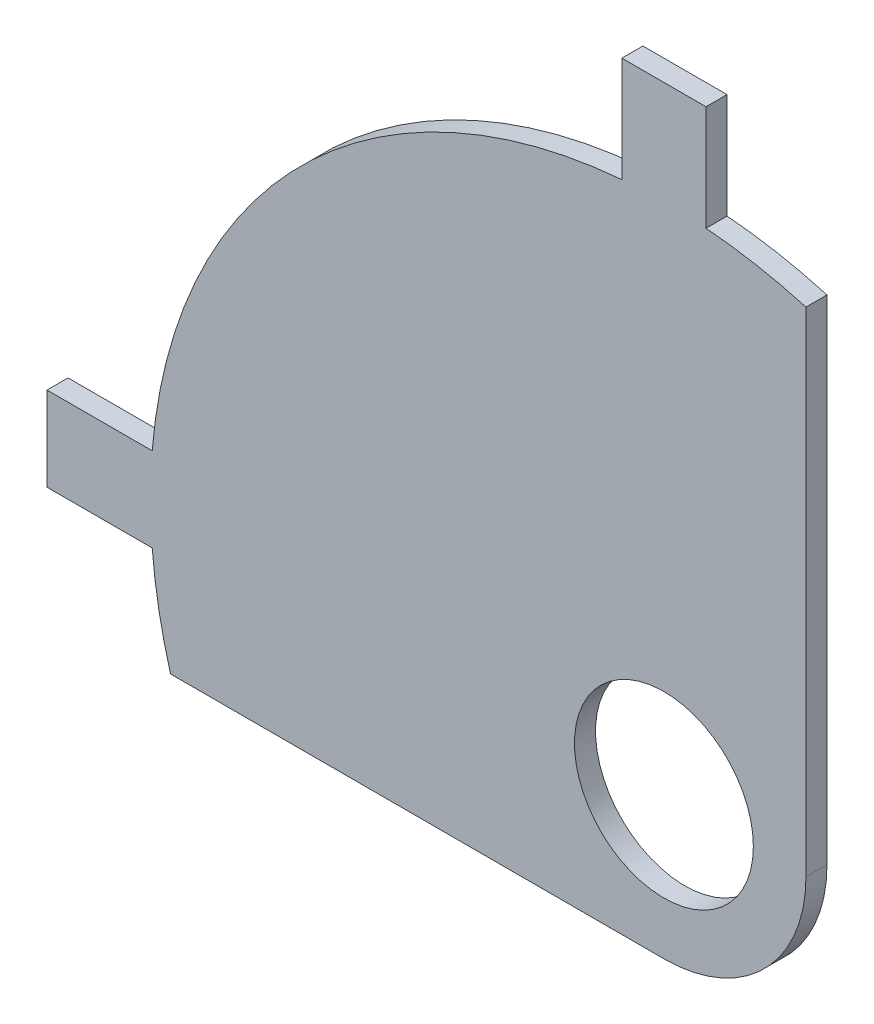
ISO-10303-21;
HEADER;
FILE_DESCRIPTION(('STEP AP214'),'2;1');
FILE_NAME('part.step','',(''),(''),'','','');
FILE_SCHEMA(('AUTOMOTIVE_DESIGN { 1 0 10303 214 1 1 1 1 }'));
ENDSEC;
DATA;
#1=APPLICATION_CONTEXT('core data for automotive mechanical design processes');
#2=APPLICATION_PROTOCOL_DEFINITION('international standard','automotive_design',2000,#1);
#3=PRODUCT_CONTEXT('',#1,'mechanical');
#4=PRODUCT('Part','Part','',(#3));
#5=PRODUCT_RELATED_PRODUCT_CATEGORY('part','',(#4));
#6=PRODUCT_DEFINITION_FORMATION('','',#4);
#7=PRODUCT_DEFINITION_CONTEXT('part definition',#1,'design');
#8=PRODUCT_DEFINITION('design','',#6,#7);
#9=PRODUCT_DEFINITION_SHAPE('','',#8);
#10=(LENGTH_UNIT() NAMED_UNIT(*) SI_UNIT(.MILLI.,.METRE.));
#11=(NAMED_UNIT(*) PLANE_ANGLE_UNIT() SI_UNIT($,.RADIAN.));
#12=(NAMED_UNIT(*) SI_UNIT($,.STERADIAN.) SOLID_ANGLE_UNIT());
#13=UNCERTAINTY_MEASURE_WITH_UNIT(LENGTH_MEASURE(1.E-05),#10,'distance_accuracy_value','');
#14=(GEOMETRIC_REPRESENTATION_CONTEXT(3) GLOBAL_UNCERTAINTY_ASSIGNED_CONTEXT((#13)) GLOBAL_UNIT_ASSIGNED_CONTEXT((#10,
#11,#12)) REPRESENTATION_CONTEXT('',''));
#15=CARTESIAN_POINT('',(0.,0.,0.));
#16=DIRECTION('',(0.,0.,1.));
#17=DIRECTION('',(1.,0.,0.));
#18=AXIS2_PLACEMENT_3D('',#15,#16,#17);
#19=CARTESIAN_POINT('',(-58.6357892914263,4.,0.));
#20=DIRECTION('',(1.,0.,0.));
#21=DIRECTION('',(0.,-1.,0.));
#22=AXIS2_PLACEMENT_3D('',#19,#20,#21);
#23=PLANE('',#22);
#24=DIRECTION('',(0.,0.,1.));
#25=VECTOR('',#24,1.);
#26=CARTESIAN_POINT('',(-58.6357892914263,4.,0.));
#27=LINE('',#26,#25);
#28=CARTESIAN_POINT('',(-58.6357892914268,4.00000000000003,-2.));
#29=VERTEX_POINT('',#28);
#30=CARTESIAN_POINT('',(-58.6357892914263,4.,0.));
#31=VERTEX_POINT('',#30);
#32=EDGE_CURVE('E11',#29,#31,#27,.T.);
#33=ORIENTED_EDGE('',*,*,#32,.F.);
#34=DIRECTION('',(0.,1.,0.));
#35=VECTOR('',#34,1.);
#36=CARTESIAN_POINT('',(-58.6357892914268,-3.70587303503938E-13,-2.));
#37=LINE('',#36,#35);
#38=CARTESIAN_POINT('',(-58.6357892914267,-3.99999999999987,-2.));
#39=VERTEX_POINT('',#38);
#40=EDGE_CURVE('E116',#29,#39,#37,.F.);
#41=ORIENTED_EDGE('',*,*,#40,.T.);
#42=DIRECTION('',(0.,0.,1.));
#43=VECTOR('',#42,1.);
#44=CARTESIAN_POINT('',(-58.6357892914262,-3.99999999999984,-2.22044604925031E-13));
#45=LINE('',#44,#43);
#46=CARTESIAN_POINT('',(-58.6357892914262,-3.99999999999984,-2.22044604925031E-13));
#47=VERTEX_POINT('',#46);
#48=EDGE_CURVE('E47',#39,#47,#45,.T.);
#49=ORIENTED_EDGE('',*,*,#48,.T.);
#50=DIRECTION('',(0.,-1.,0.));
#51=VECTOR('',#50,1.);
#52=CARTESIAN_POINT('',(-58.6357892914263,4.,0.));
#53=LINE('',#52,#51);
#54=EDGE_CURVE('E181',#31,#47,#53,.T.);
#55=ORIENTED_EDGE('',*,*,#54,.F.);
#56=EDGE_LOOP('',(#33,#41,#49,#55));
#57=FACE_BOUND('',#56,.T.);
#58=ADVANCED_FACE('F37',(#57),#23,.F.);
#59=CARTESIAN_POINT('',(-48.6357892914263,-3.99999999999986,0.));
#60=DIRECTION('',(0.,1.,0.));
#61=DIRECTION('',(1.,0.,0.));
#62=AXIS2_PLACEMENT_3D('',#59,#60,#61);
#63=PLANE('',#62);
#64=ORIENTED_EDGE('',*,*,#48,.F.);
#65=DIRECTION('',(-1.,0.,0.));
#66=VECTOR('',#65,1.);
#67=CARTESIAN_POINT('',(2.43527420451528E-13,-3.99999999999986,-2.));
#68=LINE('',#67,#66);
#69=CARTESIAN_POINT('',(-48.6357892914264,-3.9999999999999,-2.));
#70=VERTEX_POINT('',#69);
#71=EDGE_CURVE('E149',#39,#70,#68,.F.);
#72=ORIENTED_EDGE('',*,*,#71,.T.);
#73=DIRECTION('',(0.,0.,1.));
#74=VECTOR('',#73,1.);
#75=CARTESIAN_POINT('',(-48.6357892914263,-3.99999999999986,0.));
#76=LINE('',#75,#74);
#77=CARTESIAN_POINT('',(-48.6357892914263,-3.99999999999986,0.));
#78=VERTEX_POINT('',#77);
#79=EDGE_CURVE('E174',#70,#78,#76,.T.);
#80=ORIENTED_EDGE('',*,*,#79,.T.);
#81=DIRECTION('',(1.,0.,0.));
#82=VECTOR('',#81,1.);
#83=CARTESIAN_POINT('',(-48.6357892914263,-3.99999999999986,0.));
#84=LINE('',#83,#82);
#85=EDGE_CURVE('E190',#47,#78,#84,.T.);
#86=ORIENTED_EDGE('',*,*,#85,.F.);
#87=EDGE_LOOP('',(#64,#72,#80,#86));
#88=FACE_BOUND('',#87,.T.);
#89=ADVANCED_FACE('F193',(#88),#63,.F.);
#90=CARTESIAN_POINT('',(1.15879528195251E-12,4.64905891561784E-13,0.));
#91=DIRECTION('',(0.,0.,-1.));
#92=DIRECTION('',(-1.,0.,0.));
#93=AXIS2_PLACEMENT_3D('',#90,#91,#92);
#94=CYLINDRICAL_SURFACE('',#93,48.8000000000013);
#95=ORIENTED_EDGE('',*,*,#79,.F.);
#96=CARTESIAN_POINT('',(1.15879528195251E-12,4.64905891561784E-13,-2.));
#97=DIRECTION('',(0.,0.,1.));
#98=DIRECTION('',(1.,0.,0.));
#99=AXIS2_PLACEMENT_3D('',#96,#97,#98);
#100=CIRCLE('',#99,48.8000000000013);
#101=CARTESIAN_POINT('',(-46.8955221742975,-13.5,-2.));
#102=VERTEX_POINT('',#101);
#103=EDGE_CURVE('E146',#70,#102,#100,.T.);
#104=ORIENTED_EDGE('',*,*,#103,.T.);
#105=DIRECTION('',(0.,0.,1.));
#106=VECTOR('',#105,1.);
#107=CARTESIAN_POINT('',(-46.8955221742972,-13.4999999999998,0.));
#108=LINE('',#107,#106);
#109=CARTESIAN_POINT('',(-46.8955221742972,-13.4999999999998,0.));
#110=VERTEX_POINT('',#109);
#111=EDGE_CURVE('E171',#102,#110,#108,.T.);
#112=ORIENTED_EDGE('',*,*,#111,.T.);
#113=CARTESIAN_POINT('',(1.15879528195251E-12,4.64905891561784E-13,0.));
#114=DIRECTION('',(0.,0.,1.));
#115=DIRECTION('',(-1.,0.,0.));
#116=AXIS2_PLACEMENT_3D('',#113,#114,#115);
#117=CIRCLE('',#116,48.8000000000013);
#118=EDGE_CURVE('E194',#78,#110,#117,.T.);
#119=ORIENTED_EDGE('',*,*,#118,.F.);
#120=EDGE_LOOP('',(#95,#104,#112,#119));
#121=FACE_BOUND('',#120,.T.);
#122=ADVANCED_FACE('F251',(#121),#94,.T.);
#123=CARTESIAN_POINT('',(-1.17961196366423E-13,-13.5,0.));
#124=DIRECTION('',(0.,1.,0.));
#125=DIRECTION('',(1.,0.,0.));
#126=AXIS2_PLACEMENT_3D('',#123,#124,#125);
#127=PLANE('',#126);
#128=ORIENTED_EDGE('',*,*,#111,.F.);
#129=DIRECTION('',(-1.,0.,0.));
#130=VECTOR('',#129,1.);
#131=CARTESIAN_POINT('',(2.45109488261619E-13,-13.4999999999999,-2.));
#132=LINE('',#131,#130);
#133=CARTESIAN_POINT('',(-1.17961196366426E-13,-13.5000000000001,-2.));
#134=VERTEX_POINT('',#133);
#135=EDGE_CURVE('E143',#102,#134,#132,.F.);
#136=ORIENTED_EDGE('',*,*,#135,.T.);
#137=DIRECTION('',(0.,0.,1.));
#138=VECTOR('',#137,1.);
#139=CARTESIAN_POINT('',(-1.17961196366423E-13,-13.5,0.));
#140=LINE('',#139,#138);
#141=CARTESIAN_POINT('',(-1.17961196366423E-13,-13.5,0.));
#142=VERTEX_POINT('',#141);
#143=EDGE_CURVE('E168',#134,#142,#140,.T.);
#144=ORIENTED_EDGE('',*,*,#143,.T.);
#145=DIRECTION('',(1.,0.,0.));
#146=VECTOR('',#145,1.);
#147=CARTESIAN_POINT('',(-1.17961196366423E-13,-13.5,0.));
#148=LINE('',#147,#146);
#149=EDGE_CURVE('E196',#110,#142,#148,.T.);
#150=ORIENTED_EDGE('',*,*,#149,.F.);
#151=EDGE_LOOP('',(#128,#136,#144,#150));
#152=FACE_BOUND('',#151,.T.);
#153=ADVANCED_FACE('F256',(#152),#127,.F.);
#154=CARTESIAN_POINT('',(0.,0.,0.));
#155=DIRECTION('',(0.,0.,-1.));
#156=DIRECTION('',(-1.,0.,0.));
#157=AXIS2_PLACEMENT_3D('',#154,#155,#156);
#158=CYLINDRICAL_SURFACE('',#157,13.5);
#159=ORIENTED_EDGE('',*,*,#143,.F.);
#160=CARTESIAN_POINT('',(0.,0.,-2.));
#161=DIRECTION('',(0.,0.,1.));
#162=DIRECTION('',(1.,0.,0.));
#163=AXIS2_PLACEMENT_3D('',#160,#161,#162);
#164=CIRCLE('',#163,13.5);
#165=CARTESIAN_POINT('',(13.5000000000003,1.45716771982056E-13,-2.));
#166=VERTEX_POINT('',#165);
#167=EDGE_CURVE('E140',#134,#166,#164,.T.);
#168=ORIENTED_EDGE('',*,*,#167,.T.);
#169=DIRECTION('',(0.,0.,1.));
#170=VECTOR('',#169,1.);
#171=CARTESIAN_POINT('',(13.5000000000002,1.45716771982052E-13,0.));
#172=LINE('',#171,#170);
#173=CARTESIAN_POINT('',(13.5000000000002,1.45716771982052E-13,0.));
#174=VERTEX_POINT('',#173);
#175=EDGE_CURVE('E165',#166,#174,#172,.T.);
#176=ORIENTED_EDGE('',*,*,#175,.T.);
#177=CARTESIAN_POINT('',(0.,0.,0.));
#178=DIRECTION('',(0.,0.,1.));
#179=DIRECTION('',(-1.,0.,0.));
#180=AXIS2_PLACEMENT_3D('',#177,#178,#179);
#181=CIRCLE('',#180,13.5);
#182=EDGE_CURVE('E202',#142,#174,#181,.T.);
#183=ORIENTED_EDGE('',*,*,#182,.F.);
#184=EDGE_LOOP('',(#159,#168,#176,#183));
#185=FACE_BOUND('',#184,.T.);
#186=ADVANCED_FACE('F258',(#185),#158,.T.);
#187=CARTESIAN_POINT('',(13.4999999999999,46.8955221742973,-2.22044604925031E-13));
#188=DIRECTION('',(-1.,0.,0.));
#189=DIRECTION('',(0.,1.,0.));
#190=AXIS2_PLACEMENT_3D('',#187,#188,#189);
#191=PLANE('',#190);
#192=ORIENTED_EDGE('',*,*,#175,.F.);
#193=DIRECTION('',(0.,1.,0.));
#194=VECTOR('',#193,1.);
#195=CARTESIAN_POINT('',(13.5000000000003,-3.5857428137831E-13,-2.));
#196=LINE('',#195,#194);
#197=CARTESIAN_POINT('',(13.5000000000004,46.8955221742974,-2.));
#198=VERTEX_POINT('',#197);
#199=EDGE_CURVE('E137',#166,#198,#196,.T.);
#200=ORIENTED_EDGE('',*,*,#199,.T.);
#201=DIRECTION('',(0.,0.,1.));
#202=VECTOR('',#201,1.);
#203=CARTESIAN_POINT('',(13.4999999999999,46.8955221742973,-2.22044604925031E-13));
#204=LINE('',#203,#202);
#205=CARTESIAN_POINT('',(13.4999999999999,46.8955221742973,-2.22044604925031E-13));
#206=VERTEX_POINT('',#205);
#207=EDGE_CURVE('E162',#198,#206,#204,.T.);
#208=ORIENTED_EDGE('',*,*,#207,.T.);
#209=DIRECTION('',(0.,1.,0.));
#210=VECTOR('',#209,1.);
#211=CARTESIAN_POINT('',(13.4999999999999,46.8955221742973,-2.22044604925031E-13));
#212=LINE('',#211,#210);
#213=EDGE_CURVE('E205',#174,#206,#212,.T.);
#214=ORIENTED_EDGE('',*,*,#213,.F.);
#215=EDGE_LOOP('',(#192,#200,#208,#214));
#216=FACE_BOUND('',#215,.T.);
#217=ADVANCED_FACE('F239',(#216),#191,.F.);
#218=CARTESIAN_POINT('',(-2.47718512369488E-12,-1.35447209004269E-11,0.));
#219=DIRECTION('',(0.,0.,-1.));
#220=DIRECTION('',(-1.,0.,0.));
#221=AXIS2_PLACEMENT_3D('',#218,#219,#220);
#222=CYLINDRICAL_SURFACE('',#221,48.8000000000138);
#223=ORIENTED_EDGE('',*,*,#207,.F.);
#224=CARTESIAN_POINT('',(-2.47718512369488E-12,-1.35447209004269E-11,-2.));
#225=DIRECTION('',(0.,0.,1.));
#226=DIRECTION('',(1.,0.,0.));
#227=AXIS2_PLACEMENT_3D('',#224,#225,#226);
#228=CIRCLE('',#227,48.8000000000138);
#229=CARTESIAN_POINT('',(4.00000000000007,48.6357892914264,-2.));
#230=VERTEX_POINT('',#229);
#231=EDGE_CURVE('E134',#198,#230,#228,.T.);
#232=ORIENTED_EDGE('',*,*,#231,.T.);
#233=DIRECTION('',(0.,0.,1.));
#234=VECTOR('',#233,1.);
#235=CARTESIAN_POINT('',(4.,48.6357892914263,-2.22044604925031E-13));
#236=LINE('',#235,#234);
#237=CARTESIAN_POINT('',(4.,48.6357892914263,-2.22044604925031E-13));
#238=VERTEX_POINT('',#237);
#239=EDGE_CURVE('E159',#230,#238,#236,.T.);
#240=ORIENTED_EDGE('',*,*,#239,.T.);
#241=CARTESIAN_POINT('',(-2.47718512369488E-12,-1.35447209004269E-11,0.));
#242=DIRECTION('',(0.,0.,1.));
#243=DIRECTION('',(-1.,0.,0.));
#244=AXIS2_PLACEMENT_3D('',#241,#242,#243);
#245=CIRCLE('',#244,48.8000000000138);
#246=EDGE_CURVE('E208',#206,#238,#245,.T.);
#247=ORIENTED_EDGE('',*,*,#246,.F.);
#248=EDGE_LOOP('',(#223,#232,#240,#247));
#249=FACE_BOUND('',#248,.T.);
#250=ADVANCED_FACE('F231',(#249),#222,.T.);
#251=CARTESIAN_POINT('',(4.,48.6357892914263,-2.22044604925031E-13));
#252=DIRECTION('',(-1.,0.,0.));
#253=DIRECTION('',(0.,1.,0.));
#254=AXIS2_PLACEMENT_3D('',#251,#252,#253);
#255=PLANE('',#254);
#256=ORIENTED_EDGE('',*,*,#239,.F.);
#257=DIRECTION('',(0.,1.,0.));
#258=VECTOR('',#257,1.);
#259=CARTESIAN_POINT('',(4.00000000000004,-3.60156349188401E-13,-2.));
#260=LINE('',#259,#258);
#261=CARTESIAN_POINT('',(4.0000000000002,58.6357892914268,-2.));
#262=VERTEX_POINT('',#261);
#263=EDGE_CURVE('E131',#230,#262,#260,.T.);
#264=ORIENTED_EDGE('',*,*,#263,.T.);
#265=DIRECTION('',(0.,0.,1.));
#266=VECTOR('',#265,1.);
#267=CARTESIAN_POINT('',(4.00000000000017,58.6357892914263,-2.22044604925031E-13));
#268=LINE('',#267,#266);
#269=CARTESIAN_POINT('',(4.00000000000017,58.6357892914263,-2.22044604925031E-13));
#270=VERTEX_POINT('',#269);
#271=EDGE_CURVE('E156',#262,#270,#268,.T.);
#272=ORIENTED_EDGE('',*,*,#271,.T.);
#273=DIRECTION('',(0.,1.,0.));
#274=VECTOR('',#273,1.);
#275=CARTESIAN_POINT('',(4.,48.6357892914263,-2.22044604925031E-13));
#276=LINE('',#275,#274);
#277=EDGE_CURVE('E211',#238,#270,#276,.T.);
#278=ORIENTED_EDGE('',*,*,#277,.F.);
#279=EDGE_LOOP('',(#256,#264,#272,#278));
#280=FACE_BOUND('',#279,.T.);
#281=ADVANCED_FACE('F226',(#280),#255,.F.);
#282=CARTESIAN_POINT('',(-4.00000000000003,58.6357892914263,-2.22044604925031E-13));
#283=DIRECTION('',(0.,-1.,0.));
#284=DIRECTION('',(-1.,0.,0.));
#285=AXIS2_PLACEMENT_3D('',#282,#283,#284);
#286=PLANE('',#285);
#287=ORIENTED_EDGE('',*,*,#271,.F.);
#288=DIRECTION('',(-1.,0.,0.));
#289=VECTOR('',#288,1.);
#290=CARTESIAN_POINT('',(2.33096466135991E-13,58.6357892914268,-2.));
#291=LINE('',#290,#289);
#292=CARTESIAN_POINT('',(-4.00000000000006,58.6357892914268,-2.));
#293=VERTEX_POINT('',#292);
#294=EDGE_CURVE('E128',#262,#293,#291,.T.);
#295=ORIENTED_EDGE('',*,*,#294,.T.);
#296=DIRECTION('',(0.,0.,1.));
#297=VECTOR('',#296,1.);
#298=CARTESIAN_POINT('',(-4.00000000000003,58.6357892914263,-2.22044604925031E-13));
#299=LINE('',#298,#297);
#300=CARTESIAN_POINT('',(-4.00000000000003,58.6357892914263,-2.22044604925031E-13));
#301=VERTEX_POINT('',#300);
#302=EDGE_CURVE('E154',#293,#301,#299,.T.);
#303=ORIENTED_EDGE('',*,*,#302,.T.);
#304=DIRECTION('',(-1.,0.,0.));
#305=VECTOR('',#304,1.);
#306=CARTESIAN_POINT('',(-4.00000000000003,58.6357892914263,-2.22044604925031E-13));
#307=LINE('',#306,#305);
#308=EDGE_CURVE('E214',#270,#301,#307,.T.);
#309=ORIENTED_EDGE('',*,*,#308,.F.);
#310=EDGE_LOOP('',(#287,#295,#303,#309));
#311=FACE_BOUND('',#310,.T.);
#312=ADVANCED_FACE('F222',(#311),#286,.F.);
#313=CARTESIAN_POINT('',(-3.99999999999989,48.6357892914263,-2.22044604925031E-13));
#314=DIRECTION('',(1.,0.,0.));
#315=DIRECTION('',(0.,-1.,0.));
#316=AXIS2_PLACEMENT_3D('',#313,#314,#315);
#317=PLANE('',#316);
#318=ORIENTED_EDGE('',*,*,#302,.F.);
#319=DIRECTION('',(0.,1.,0.));
#320=VECTOR('',#319,1.);
#321=CARTESIAN_POINT('',(-4.00000000000005,-3.61488616817951E-13,-2.));
#322=LINE('',#321,#320);
#323=CARTESIAN_POINT('',(-4.00000000000009,48.6357892914263,-2.));
#324=VERTEX_POINT('',#323);
#325=EDGE_CURVE('E125',#293,#324,#322,.F.);
#326=ORIENTED_EDGE('',*,*,#325,.T.);
#327=DIRECTION('',(0.,0.,1.));
#328=VECTOR('',#327,1.);
#329=CARTESIAN_POINT('',(-3.99999999999989,48.6357892914263,-2.22044604925031E-13));
#330=LINE('',#329,#328);
#331=CARTESIAN_POINT('',(-3.99999999999989,48.6357892914263,-2.22044604925031E-13));
#332=VERTEX_POINT('',#331);
#333=EDGE_CURVE('E55',#324,#332,#330,.T.);
#334=ORIENTED_EDGE('',*,*,#333,.T.);
#335=DIRECTION('',(0.,-1.,0.));
#336=VECTOR('',#335,1.);
#337=CARTESIAN_POINT('',(-3.99999999999989,48.6357892914263,-2.22044604925031E-13));
#338=LINE('',#337,#336);
#339=EDGE_CURVE('E109',#301,#332,#338,.T.);
#340=ORIENTED_EDGE('',*,*,#339,.F.);
#341=EDGE_LOOP('',(#318,#326,#334,#340));
#342=FACE_BOUND('',#341,.T.);
#343=ADVANCED_FACE('F219',(#342),#317,.F.);
#344=CARTESIAN_POINT('',(2.42861286636753E-13,-3.60822483003176E-13,0.));
#345=DIRECTION('',(0.,0.,-1.));
#346=DIRECTION('',(-1.,0.,0.));
#347=AXIS2_PLACEMENT_3D('',#344,#345,#346);
#348=CYLINDRICAL_SURFACE('',#347,48.8000000000004);
#349=ORIENTED_EDGE('',*,*,#333,.F.);
#350=CARTESIAN_POINT('',(2.42861286636753E-13,-3.60822483003176E-13,-2.));
#351=DIRECTION('',(0.,0.,1.));
#352=DIRECTION('',(1.,0.,0.));
#353=AXIS2_PLACEMENT_3D('',#350,#351,#352);
#354=CIRCLE('',#353,48.8000000000004);
#355=CARTESIAN_POINT('',(-48.6357892914264,4.00000000000012,-2.));
#356=VERTEX_POINT('',#355);
#357=EDGE_CURVE('E114',#324,#356,#354,.T.);
#358=ORIENTED_EDGE('',*,*,#357,.T.);
#359=DIRECTION('',(0.,0.,1.));
#360=VECTOR('',#359,1.);
#361=CARTESIAN_POINT('',(-48.6357892914263,4.00000000000006,0.));
#362=LINE('',#361,#360);
#363=CARTESIAN_POINT('',(-48.6357892914263,4.00000000000006,0.));
#364=VERTEX_POINT('',#363);
#365=EDGE_CURVE('E41',#356,#364,#362,.T.);
#366=ORIENTED_EDGE('',*,*,#365,.T.);
#367=CARTESIAN_POINT('',(2.42861286636753E-13,-3.60822483003176E-13,0.));
#368=DIRECTION('',(0.,0.,1.));
#369=DIRECTION('',(-1.,0.,0.));
#370=AXIS2_PLACEMENT_3D('',#367,#368,#369);
#371=CIRCLE('',#370,48.8000000000004);
#372=EDGE_CURVE('E217',#332,#364,#371,.T.);
#373=ORIENTED_EDGE('',*,*,#372,.F.);
#374=EDGE_LOOP('',(#349,#358,#366,#373));
#375=FACE_BOUND('',#374,.T.);
#376=ADVANCED_FACE('F118',(#375),#348,.T.);
#377=CARTESIAN_POINT('',(0.,0.,0.));
#378=DIRECTION('',(0.,0.,-1.));
#379=DIRECTION('',(-1.,0.,0.));
#380=AXIS2_PLACEMENT_3D('',#377,#378,#379);
#381=CYLINDRICAL_SURFACE('',#380,8.5);
#382=CARTESIAN_POINT('',(0.,0.,0.));
#383=DIRECTION('',(0.,0.,1.));
#384=DIRECTION('',(1.,0.,0.));
#385=AXIS2_PLACEMENT_3D('',#382,#383,#384);
#386=CIRCLE('',#385,8.5);
#387=CARTESIAN_POINT('',(8.50000000000004,0.,0.));
#388=VERTEX_POINT('',#387);
#389=EDGE_CURVE('E127',#388,#388,#386,.T.);
#390=ORIENTED_EDGE('',*,*,#389,.T.);
#391=EDGE_LOOP('',(#390));
#392=FACE_BOUND('',#391,.T.);
#393=CARTESIAN_POINT('',(0.,0.,-2.));
#394=DIRECTION('',(0.,0.,1.));
#395=DIRECTION('',(1.,0.,0.));
#396=AXIS2_PLACEMENT_3D('',#393,#394,#395);
#397=CIRCLE('',#396,8.5);
#398=CARTESIAN_POINT('',(8.5,0.,-2.));
#399=VERTEX_POINT('',#398);
#400=EDGE_CURVE('E119',#399,#399,#397,.T.);
#401=ORIENTED_EDGE('',*,*,#400,.F.);
#402=EDGE_LOOP('',(#401));
#403=FACE_BOUND('',#402,.T.);
#404=ADVANCED_FACE('F341',(#392,#403),#381,.F.);
#405=CARTESIAN_POINT('',(-48.6357892914263,4.00000000000006,0.));
#406=DIRECTION('',(0.,-1.,0.));
#407=DIRECTION('',(-1.,0.,0.));
#408=AXIS2_PLACEMENT_3D('',#405,#406,#407);
#409=PLANE('',#408);
#410=DIRECTION('',(-1.,0.,0.));
#411=VECTOR('',#410,1.);
#412=CARTESIAN_POINT('',(2.42195152821978E-13,4.0000000000001,-2.));
#413=LINE('',#412,#411);
#414=EDGE_CURVE('E103',#356,#29,#413,.T.);
#415=ORIENTED_EDGE('',*,*,#414,.T.);
#416=ORIENTED_EDGE('',*,*,#32,.T.);
#417=DIRECTION('',(-1.,0.,0.));
#418=VECTOR('',#417,1.);
#419=CARTESIAN_POINT('',(-48.6357892914263,4.00000000000006,0.));
#420=LINE('',#419,#418);
#421=EDGE_CURVE('E105',#364,#31,#420,.T.);
#422=ORIENTED_EDGE('',*,*,#421,.F.);
#423=ORIENTED_EDGE('',*,*,#365,.F.);
#424=EDGE_LOOP('',(#415,#416,#422,#423));
#425=FACE_BOUND('',#424,.T.);
#426=ADVANCED_FACE('F39',(#425),#409,.F.);
#427=CARTESIAN_POINT('',(2.42861286636753E-13,-3.60822483003176E-13,0.));
#428=DIRECTION('',(0.,0.,-1.));
#429=DIRECTION('',(-1.,0.,0.));
#430=AXIS2_PLACEMENT_3D('',#427,#428,#429);
#431=PLANE('',#430);
#432=ORIENTED_EDGE('',*,*,#389,.F.);
#433=EDGE_LOOP('',(#432));
#434=FACE_BOUND('',#433,.T.);
#435=ORIENTED_EDGE('',*,*,#372,.T.);
#436=ORIENTED_EDGE('',*,*,#421,.T.);
#437=ORIENTED_EDGE('',*,*,#54,.T.);
#438=ORIENTED_EDGE('',*,*,#85,.T.);
#439=ORIENTED_EDGE('',*,*,#118,.T.);
#440=ORIENTED_EDGE('',*,*,#149,.T.);
#441=ORIENTED_EDGE('',*,*,#182,.T.);
#442=ORIENTED_EDGE('',*,*,#213,.T.);
#443=ORIENTED_EDGE('',*,*,#246,.T.);
#444=ORIENTED_EDGE('',*,*,#277,.T.);
#445=ORIENTED_EDGE('',*,*,#308,.T.);
#446=ORIENTED_EDGE('',*,*,#339,.T.);
#447=EDGE_LOOP('',(#435,#436,#437,#438,#439,#440,#441,#442,#443,#444,#445,#446));
#448=FACE_BOUND('',#447,.T.);
#449=ADVANCED_FACE('F188',(#434,#448),#431,.F.);
#450=CARTESIAN_POINT('',(2.42861286636753E-13,-3.60822483003176E-13,-2.));
#451=DIRECTION('',(0.,0.,-1.));
#452=DIRECTION('',(-1.,0.,0.));
#453=AXIS2_PLACEMENT_3D('',#450,#451,#452);
#454=PLANE('',#453);
#455=ORIENTED_EDGE('',*,*,#400,.T.);
#456=EDGE_LOOP('',(#455));
#457=FACE_BOUND('',#456,.T.);
#458=ORIENTED_EDGE('',*,*,#357,.F.);
#459=ORIENTED_EDGE('',*,*,#325,.F.);
#460=ORIENTED_EDGE('',*,*,#294,.F.);
#461=ORIENTED_EDGE('',*,*,#263,.F.);
#462=ORIENTED_EDGE('',*,*,#231,.F.);
#463=ORIENTED_EDGE('',*,*,#199,.F.);
#464=ORIENTED_EDGE('',*,*,#167,.F.);
#465=ORIENTED_EDGE('',*,*,#135,.F.);
#466=ORIENTED_EDGE('',*,*,#103,.F.);
#467=ORIENTED_EDGE('',*,*,#71,.F.);
#468=ORIENTED_EDGE('',*,*,#40,.F.);
#469=ORIENTED_EDGE('',*,*,#414,.F.);
#470=EDGE_LOOP('',(#458,#459,#460,#461,#462,#463,#464,#465,#466,#467,#468,#469));
#471=FACE_BOUND('',#470,.T.);
#472=ADVANCED_FACE('F112',(#457,#471),#454,.T.);
#473=CLOSED_SHELL('',(#58,#89,#122,#153,#186,#217,#250,#281,#312,#343,#376,#404,#426,#449,#472));
#474=MANIFOLD_SOLID_BREP('B2',#473);
#475=ADVANCED_BREP_SHAPE_REPRESENTATION('',(#18,#474),#14);
#476=SHAPE_DEFINITION_REPRESENTATION(#9,#475);
ENDSEC;
END-ISO-10303-21;
